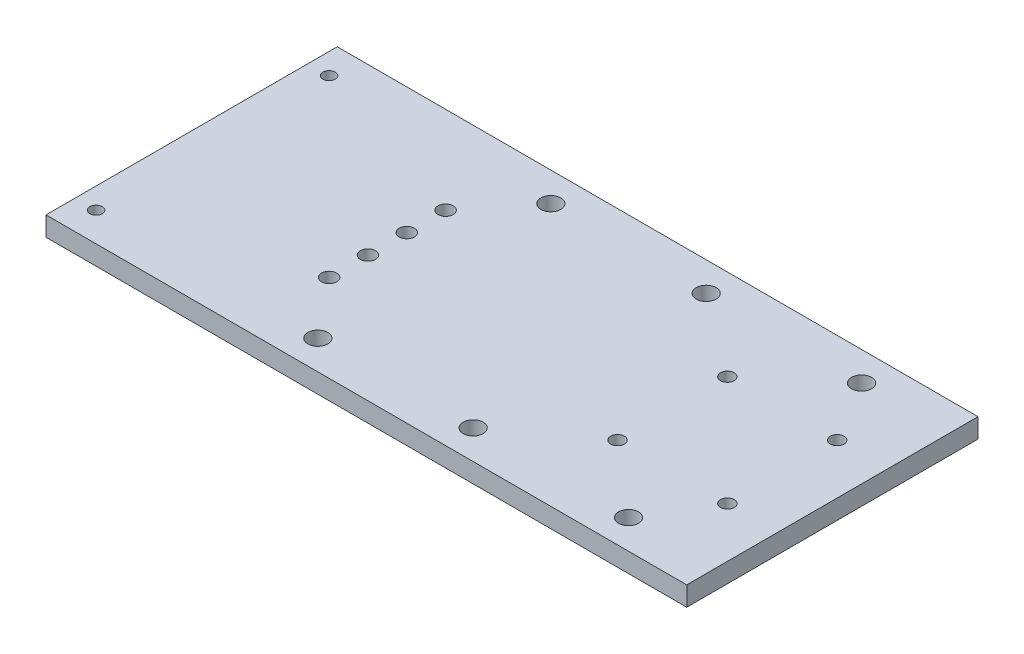
ISO-10303-21;
HEADER;
FILE_DESCRIPTION(('STEP AP214'),'2;1');
FILE_NAME('part.step','',(''),(''),'','','');
FILE_SCHEMA(('AUTOMOTIVE_DESIGN { 1 0 10303 214 1 1 1 1 }'));
ENDSEC;
DATA;
#1=APPLICATION_CONTEXT('core data for automotive mechanical design processes');
#2=APPLICATION_PROTOCOL_DEFINITION('international standard','automotive_design',2000,#1);
#3=PRODUCT_CONTEXT('',#1,'mechanical');
#4=PRODUCT('Part','Part','',(#3));
#5=PRODUCT_RELATED_PRODUCT_CATEGORY('part','',(#4));
#6=PRODUCT_DEFINITION_FORMATION('','',#4);
#7=PRODUCT_DEFINITION_CONTEXT('part definition',#1,'design');
#8=PRODUCT_DEFINITION('design','',#6,#7);
#9=PRODUCT_DEFINITION_SHAPE('','',#8);
#10=(LENGTH_UNIT() NAMED_UNIT(*) SI_UNIT(.MILLI.,.METRE.));
#11=(NAMED_UNIT(*) PLANE_ANGLE_UNIT() SI_UNIT($,.RADIAN.));
#12=(NAMED_UNIT(*) SI_UNIT($,.STERADIAN.) SOLID_ANGLE_UNIT());
#13=UNCERTAINTY_MEASURE_WITH_UNIT(LENGTH_MEASURE(1.E-05),#10,'distance_accuracy_value','');
#14=(GEOMETRIC_REPRESENTATION_CONTEXT(3) GLOBAL_UNCERTAINTY_ASSIGNED_CONTEXT((#13)) GLOBAL_UNIT_ASSIGNED_CONTEXT((#10,
#11,#12)) REPRESENTATION_CONTEXT('',''));
#15=CARTESIAN_POINT('',(0.,0.,0.));
#16=DIRECTION('',(0.,0.,1.));
#17=DIRECTION('',(1.,0.,0.));
#18=AXIS2_PLACEMENT_3D('',#15,#16,#17);
#19=CARTESIAN_POINT('',(104.775,6.35,47.625));
#20=DIRECTION('',(-1.,0.,0.));
#21=DIRECTION('',(0.,0.,1.));
#22=AXIS2_PLACEMENT_3D('',#19,#20,#21);
#23=PLANE('',#22);
#24=DIRECTION('',(0.,0.,-1.));
#25=VECTOR('',#24,1.);
#26=CARTESIAN_POINT('',(104.775,0.,47.625));
#27=LINE('',#26,#25);
#28=CARTESIAN_POINT('',(104.775,0.,47.625));
#29=VERTEX_POINT('',#28);
#30=CARTESIAN_POINT('',(104.775,0.,-47.625));
#31=VERTEX_POINT('',#30);
#32=EDGE_CURVE('E118',#29,#31,#27,.T.);
#33=ORIENTED_EDGE('',*,*,#32,.T.);
#34=DIRECTION('',(0.,-1.,0.));
#35=VECTOR('',#34,1.);
#36=CARTESIAN_POINT('',(104.775,6.35,-47.625));
#37=LINE('',#36,#35);
#38=CARTESIAN_POINT('',(104.775,6.35,-47.625));
#39=VERTEX_POINT('',#38);
#40=EDGE_CURVE('E13',#39,#31,#37,.T.);
#41=ORIENTED_EDGE('',*,*,#40,.F.);
#42=DIRECTION('',(0.,0.,-1.));
#43=VECTOR('',#42,1.);
#44=CARTESIAN_POINT('',(104.775,6.35,47.625));
#45=LINE('',#44,#43);
#46=CARTESIAN_POINT('',(104.775,6.35,47.625));
#47=VERTEX_POINT('',#46);
#48=EDGE_CURVE('E102',#47,#39,#45,.T.);
#49=ORIENTED_EDGE('',*,*,#48,.F.);
#50=DIRECTION('',(0.,-1.,0.));
#51=VECTOR('',#50,1.);
#52=CARTESIAN_POINT('',(104.775,6.35,47.625));
#53=LINE('',#52,#51);
#54=EDGE_CURVE('E114',#47,#29,#53,.T.);
#55=ORIENTED_EDGE('',*,*,#54,.T.);
#56=EDGE_LOOP('',(#33,#41,#49,#55));
#57=FACE_BOUND('',#56,.T.);
#58=ADVANCED_FACE('F50',(#57),#23,.F.);
#59=CARTESIAN_POINT('',(-104.775,6.35,-47.625));
#60=DIRECTION('',(0.,0.,1.));
#61=DIRECTION('',(1.,0.,0.));
#62=AXIS2_PLACEMENT_3D('',#59,#60,#61);
#63=PLANE('',#62);
#64=DIRECTION('',(-1.,0.,0.));
#65=VECTOR('',#64,1.);
#66=CARTESIAN_POINT('',(-104.775,0.,-47.625));
#67=LINE('',#66,#65);
#68=CARTESIAN_POINT('',(-104.775,0.,-47.625));
#69=VERTEX_POINT('',#68);
#70=EDGE_CURVE('E107',#31,#69,#67,.T.);
#71=ORIENTED_EDGE('',*,*,#70,.T.);
#72=DIRECTION('',(0.,-1.,0.));
#73=VECTOR('',#72,1.);
#74=CARTESIAN_POINT('',(-104.775,6.35,-47.625));
#75=LINE('',#74,#73);
#76=CARTESIAN_POINT('',(-104.775,6.35,-47.625));
#77=VERTEX_POINT('',#76);
#78=EDGE_CURVE('E59',#77,#69,#75,.T.);
#79=ORIENTED_EDGE('',*,*,#78,.F.);
#80=DIRECTION('',(-1.,0.,0.));
#81=VECTOR('',#80,1.);
#82=CARTESIAN_POINT('',(-104.775,6.35,-47.625));
#83=LINE('',#82,#81);
#84=EDGE_CURVE('E97',#39,#77,#83,.T.);
#85=ORIENTED_EDGE('',*,*,#84,.F.);
#86=ORIENTED_EDGE('',*,*,#40,.T.);
#87=EDGE_LOOP('',(#71,#79,#85,#86));
#88=FACE_BOUND('',#87,.T.);
#89=ADVANCED_FACE('F106',(#88),#63,.F.);
#90=CARTESIAN_POINT('',(-104.775,6.35,47.625));
#91=DIRECTION('',(1.,0.,0.));
#92=DIRECTION('',(0.,0.,-1.));
#93=AXIS2_PLACEMENT_3D('',#90,#91,#92);
#94=PLANE('',#93);
#95=DIRECTION('',(0.,0.,1.));
#96=VECTOR('',#95,1.);
#97=CARTESIAN_POINT('',(-104.775,0.,47.625));
#98=LINE('',#97,#96);
#99=CARTESIAN_POINT('',(-104.775,0.,47.625));
#100=VERTEX_POINT('',#99);
#101=EDGE_CURVE('E84',#69,#100,#98,.T.);
#102=ORIENTED_EDGE('',*,*,#101,.T.);
#103=DIRECTION('',(0.,-1.,0.));
#104=VECTOR('',#103,1.);
#105=CARTESIAN_POINT('',(-104.775,6.35,47.625));
#106=LINE('',#105,#104);
#107=CARTESIAN_POINT('',(-104.775,6.35,47.625));
#108=VERTEX_POINT('',#107);
#109=EDGE_CURVE('E109',#108,#100,#106,.T.);
#110=ORIENTED_EDGE('',*,*,#109,.F.);
#111=DIRECTION('',(0.,0.,1.));
#112=VECTOR('',#111,1.);
#113=CARTESIAN_POINT('',(-104.775,6.35,47.625));
#114=LINE('',#113,#112);
#115=EDGE_CURVE('E100',#77,#108,#114,.T.);
#116=ORIENTED_EDGE('',*,*,#115,.F.);
#117=ORIENTED_EDGE('',*,*,#78,.T.);
#118=EDGE_LOOP('',(#102,#110,#116,#117));
#119=FACE_BOUND('',#118,.T.);
#120=ADVANCED_FACE('F110',(#119),#94,.F.);
#121=CARTESIAN_POINT('',(-104.775,6.35,47.625));
#122=DIRECTION('',(0.,0.,-1.));
#123=DIRECTION('',(-1.,0.,0.));
#124=AXIS2_PLACEMENT_3D('',#121,#122,#123);
#125=PLANE('',#124);
#126=DIRECTION('',(1.,0.,0.));
#127=VECTOR('',#126,1.);
#128=CARTESIAN_POINT('',(-104.775,0.,47.625));
#129=LINE('',#128,#127);
#130=EDGE_CURVE('E90',#100,#29,#129,.T.);
#131=ORIENTED_EDGE('',*,*,#130,.T.);
#132=ORIENTED_EDGE('',*,*,#54,.F.);
#133=DIRECTION('',(1.,0.,0.));
#134=VECTOR('',#133,1.);
#135=CARTESIAN_POINT('',(-104.775,6.35,47.625));
#136=LINE('',#135,#134);
#137=EDGE_CURVE('E67',#108,#47,#136,.T.);
#138=ORIENTED_EDGE('',*,*,#137,.F.);
#139=ORIENTED_EDGE('',*,*,#109,.T.);
#140=EDGE_LOOP('',(#131,#132,#138,#139));
#141=FACE_BOUND('',#140,.T.);
#142=ADVANCED_FACE('F132',(#141),#125,.F.);
#143=CARTESIAN_POINT('',(0.,6.35,0.));
#144=DIRECTION('',(0.,-1.,0.));
#145=DIRECTION('',(0.,0.,-1.));
#146=AXIS2_PLACEMENT_3D('',#143,#144,#145);
#147=PLANE('',#146);
#148=CARTESIAN_POINT('',(-25.4,6.35,38.1));
#149=DIRECTION('',(0.,-1.,0.));
#150=DIRECTION('',(0.,0.,-1.));
#151=AXIS2_PLACEMENT_3D('',#148,#149,#150);
#152=CIRCLE('',#151,3.2639);
#153=CARTESIAN_POINT('',(-25.4,6.35,34.8361));
#154=VERTEX_POINT('',#153);
#155=EDGE_CURVE('E259',#154,#154,#152,.T.);
#156=ORIENTED_EDGE('',*,*,#155,.T.);
#157=EDGE_LOOP('',(#156));
#158=FACE_BOUND('',#157,.T.);
#159=CARTESIAN_POINT('',(25.4,6.35,38.1));
#160=DIRECTION('',(0.,-1.,0.));
#161=DIRECTION('',(0.,0.,-1.));
#162=AXIS2_PLACEMENT_3D('',#159,#160,#161);
#163=CIRCLE('',#162,3.2639);
#164=CARTESIAN_POINT('',(25.4,6.35,34.8361));
#165=VERTEX_POINT('',#164);
#166=EDGE_CURVE('E251',#165,#165,#163,.T.);
#167=ORIENTED_EDGE('',*,*,#166,.T.);
#168=EDGE_LOOP('',(#167));
#169=FACE_BOUND('',#168,.T.);
#170=CARTESIAN_POINT('',(76.2,6.35,38.1));
#171=DIRECTION('',(0.,-1.,0.));
#172=DIRECTION('',(0.,0.,-1.));
#173=AXIS2_PLACEMENT_3D('',#170,#171,#172);
#174=CIRCLE('',#173,3.2639);
#175=CARTESIAN_POINT('',(76.2,6.35,34.8361));
#176=VERTEX_POINT('',#175);
#177=EDGE_CURVE('E243',#176,#176,#174,.T.);
#178=ORIENTED_EDGE('',*,*,#177,.T.);
#179=EDGE_LOOP('',(#178));
#180=FACE_BOUND('',#179,.T.);
#181=CARTESIAN_POINT('',(-25.4,6.35,-38.1));
#182=DIRECTION('',(0.,1.,0.));
#183=DIRECTION('',(0.,0.,1.));
#184=AXIS2_PLACEMENT_3D('',#181,#182,#183);
#185=CIRCLE('',#184,3.2639);
#186=CARTESIAN_POINT('',(-25.4,6.35,-34.8361));
#187=VERTEX_POINT('',#186);
#188=EDGE_CURVE('E236',#187,#187,#185,.T.);
#189=ORIENTED_EDGE('',*,*,#188,.F.);
#190=EDGE_LOOP('',(#189));
#191=FACE_BOUND('',#190,.T.);
#192=CARTESIAN_POINT('',(25.4,6.35,-38.1));
#193=DIRECTION('',(0.,1.,0.));
#194=DIRECTION('',(0.,0.,1.));
#195=AXIS2_PLACEMENT_3D('',#192,#193,#194);
#196=CIRCLE('',#195,3.2639);
#197=CARTESIAN_POINT('',(25.4,6.35,-34.8361));
#198=VERTEX_POINT('',#197);
#199=EDGE_CURVE('E228',#198,#198,#196,.T.);
#200=ORIENTED_EDGE('',*,*,#199,.F.);
#201=EDGE_LOOP('',(#200));
#202=FACE_BOUND('',#201,.T.);
#203=CARTESIAN_POINT('',(76.2,6.35,-38.1));
#204=DIRECTION('',(0.,1.,0.));
#205=DIRECTION('',(0.,0.,1.));
#206=AXIS2_PLACEMENT_3D('',#203,#204,#205);
#207=CIRCLE('',#206,3.2639);
#208=CARTESIAN_POINT('',(76.2,6.35,-34.8361));
#209=VERTEX_POINT('',#208);
#210=EDGE_CURVE('E219',#209,#209,#207,.T.);
#211=ORIENTED_EDGE('',*,*,#210,.F.);
#212=EDGE_LOOP('',(#211));
#213=FACE_BOUND('',#212,.T.);
#214=CARTESIAN_POINT('',(52.47132,6.35,17.96034));
#215=DIRECTION('',(0.,1.,0.));
#216=DIRECTION('',(0.,0.,1.));
#217=AXIS2_PLACEMENT_3D('',#214,#215,#216);
#218=CIRCLE('',#217,2.2479);
#219=CARTESIAN_POINT('',(52.47132,6.35,20.20824));
#220=VERTEX_POINT('',#219);
#221=EDGE_CURVE('E195',#220,#220,#218,.T.);
#222=ORIENTED_EDGE('',*,*,#221,.F.);
#223=EDGE_LOOP('',(#222));
#224=FACE_BOUND('',#223,.T.);
#225=CARTESIAN_POINT('',(88.392,6.35,17.96034));
#226=DIRECTION('',(0.,1.,0.));
#227=DIRECTION('',(0.,0.,1.));
#228=AXIS2_PLACEMENT_3D('',#225,#226,#227);
#229=CIRCLE('',#228,2.2479);
#230=CARTESIAN_POINT('',(88.392,6.35,20.20824));
#231=VERTEX_POINT('',#230);
#232=EDGE_CURVE('E204',#231,#231,#229,.T.);
#233=ORIENTED_EDGE('',*,*,#232,.F.);
#234=EDGE_LOOP('',(#233));
#235=FACE_BOUND('',#234,.T.);
#236=CARTESIAN_POINT('',(88.392,6.35,-17.96034));
#237=DIRECTION('',(0.,1.,0.));
#238=DIRECTION('',(0.,0.,1.));
#239=AXIS2_PLACEMENT_3D('',#236,#237,#238);
#240=CIRCLE('',#239,2.2479);
#241=CARTESIAN_POINT('',(88.392,6.35,-15.71244));
#242=VERTEX_POINT('',#241);
#243=EDGE_CURVE('E212',#242,#242,#240,.T.);
#244=ORIENTED_EDGE('',*,*,#243,.F.);
#245=EDGE_LOOP('',(#244));
#246=FACE_BOUND('',#245,.T.);
#247=CARTESIAN_POINT('',(52.47132,6.35,-17.96034));
#248=DIRECTION('',(0.,1.,0.));
#249=DIRECTION('',(0.,0.,1.));
#250=AXIS2_PLACEMENT_3D('',#247,#248,#249);
#251=CIRCLE('',#250,2.2479);
#252=CARTESIAN_POINT('',(52.47132,6.35,-15.71244));
#253=VERTEX_POINT('',#252);
#254=EDGE_CURVE('E187',#253,#253,#251,.T.);
#255=ORIENTED_EDGE('',*,*,#254,.F.);
#256=EDGE_LOOP('',(#255));
#257=FACE_BOUND('',#256,.T.);
#258=CARTESIAN_POINT('',(-40.767,6.35,-6.35));
#259=DIRECTION('',(0.,-1.,0.));
#260=DIRECTION('',(0.,0.,-1.));
#261=AXIS2_PLACEMENT_3D('',#258,#259,#260);
#262=CIRCLE('',#261,2.4892);
#263=CARTESIAN_POINT('',(-40.767,6.35,-8.83920000000001));
#264=VERTEX_POINT('',#263);
#265=EDGE_CURVE('E180',#264,#264,#262,.T.);
#266=ORIENTED_EDGE('',*,*,#265,.T.);
#267=EDGE_LOOP('',(#266));
#268=FACE_BOUND('',#267,.T.);
#269=CARTESIAN_POINT('',(-40.767,6.35,-19.05));
#270=DIRECTION('',(0.,-1.,0.));
#271=DIRECTION('',(0.,0.,-1.));
#272=AXIS2_PLACEMENT_3D('',#269,#270,#271);
#273=CIRCLE('',#272,2.4892);
#274=CARTESIAN_POINT('',(-40.767,6.35,-21.5392));
#275=VERTEX_POINT('',#274);
#276=EDGE_CURVE('E171',#275,#275,#273,.T.);
#277=ORIENTED_EDGE('',*,*,#276,.T.);
#278=EDGE_LOOP('',(#277));
#279=FACE_BOUND('',#278,.T.);
#280=CARTESIAN_POINT('',(-40.767,6.35,6.35));
#281=DIRECTION('',(0.,1.,0.));
#282=DIRECTION('',(0.,0.,1.));
#283=AXIS2_PLACEMENT_3D('',#280,#281,#282);
#284=CIRCLE('',#283,2.4892);
#285=CARTESIAN_POINT('',(-40.767,6.35,8.83920000000001));
#286=VERTEX_POINT('',#285);
#287=EDGE_CURVE('E164',#286,#286,#284,.T.);
#288=ORIENTED_EDGE('',*,*,#287,.F.);
#289=EDGE_LOOP('',(#288));
#290=FACE_BOUND('',#289,.T.);
#291=CARTESIAN_POINT('',(-40.767,6.35,19.05));
#292=DIRECTION('',(0.,1.,0.));
#293=DIRECTION('',(0.,0.,1.));
#294=AXIS2_PLACEMENT_3D('',#291,#292,#293);
#295=CIRCLE('',#294,2.4892);
#296=CARTESIAN_POINT('',(-40.767,6.35,21.5392));
#297=VERTEX_POINT('',#296);
#298=EDGE_CURVE('E155',#297,#297,#295,.T.);
#299=ORIENTED_EDGE('',*,*,#298,.F.);
#300=EDGE_LOOP('',(#299));
#301=FACE_BOUND('',#300,.T.);
#302=CARTESIAN_POINT('',(-97.917,6.35,-38.1));
#303=DIRECTION('',(0.,-1.,0.));
#304=DIRECTION('',(0.,0.,-1.));
#305=AXIS2_PLACEMENT_3D('',#302,#303,#304);
#306=CIRCLE('',#305,2.01930000000001);
#307=CARTESIAN_POINT('',(-97.917,6.35,-40.1193));
#308=VERTEX_POINT('',#307);
#309=EDGE_CURVE('E147',#308,#308,#306,.T.);
#310=ORIENTED_EDGE('',*,*,#309,.T.);
#311=EDGE_LOOP('',(#310));
#312=FACE_BOUND('',#311,.T.);
#313=CARTESIAN_POINT('',(-97.917,6.35,38.1));
#314=DIRECTION('',(0.,1.,0.));
#315=DIRECTION('',(0.,0.,1.));
#316=AXIS2_PLACEMENT_3D('',#313,#314,#315);
#317=CIRCLE('',#316,2.01930000000001);
#318=CARTESIAN_POINT('',(-97.917,6.35,40.1193));
#319=VERTEX_POINT('',#318);
#320=EDGE_CURVE('E139',#319,#319,#317,.T.);
#321=ORIENTED_EDGE('',*,*,#320,.F.);
#322=EDGE_LOOP('',(#321));
#323=FACE_BOUND('',#322,.T.);
#324=ORIENTED_EDGE('',*,*,#48,.T.);
#325=ORIENTED_EDGE('',*,*,#84,.T.);
#326=ORIENTED_EDGE('',*,*,#115,.T.);
#327=ORIENTED_EDGE('',*,*,#137,.T.);
#328=EDGE_LOOP('',(#324,#325,#326,#327));
#329=FACE_BOUND('',#328,.T.);
#330=ADVANCED_FACE('F98',(#158,#169,#180,#191,#202,#213,#224,#235,#246,#257,#268,#279,#290,#301,
#312,#323,#329),#147,.F.);
#331=CARTESIAN_POINT('',(0.,0.,0.));
#332=DIRECTION('',(0.,-1.,0.));
#333=DIRECTION('',(0.,0.,-1.));
#334=AXIS2_PLACEMENT_3D('',#331,#332,#333);
#335=PLANE('',#334);
#336=CARTESIAN_POINT('',(-25.4,0.,38.1));
#337=DIRECTION('',(0.,-1.,0.));
#338=DIRECTION('',(0.,0.,-1.));
#339=AXIS2_PLACEMENT_3D('',#336,#337,#338);
#340=CIRCLE('',#339,3.2639);
#341=CARTESIAN_POINT('',(-25.4,0.,34.8361));
#342=VERTEX_POINT('',#341);
#343=EDGE_CURVE('E224',#342,#342,#340,.T.);
#344=ORIENTED_EDGE('',*,*,#343,.F.);
#345=EDGE_LOOP('',(#344));
#346=FACE_BOUND('',#345,.T.);
#347=CARTESIAN_POINT('',(25.4,0.,38.1));
#348=DIRECTION('',(0.,-1.,0.));
#349=DIRECTION('',(0.,0.,-1.));
#350=AXIS2_PLACEMENT_3D('',#347,#348,#349);
#351=CIRCLE('',#350,3.2639);
#352=CARTESIAN_POINT('',(25.4,0.,34.8361));
#353=VERTEX_POINT('',#352);
#354=EDGE_CURVE('E255',#353,#353,#351,.T.);
#355=ORIENTED_EDGE('',*,*,#354,.F.);
#356=EDGE_LOOP('',(#355));
#357=FACE_BOUND('',#356,.T.);
#358=CARTESIAN_POINT('',(76.2,0.,38.1));
#359=DIRECTION('',(0.,-1.,0.));
#360=DIRECTION('',(0.,0.,-1.));
#361=AXIS2_PLACEMENT_3D('',#358,#359,#360);
#362=CIRCLE('',#361,3.2639);
#363=CARTESIAN_POINT('',(76.2,0.,34.8361));
#364=VERTEX_POINT('',#363);
#365=EDGE_CURVE('E247',#364,#364,#362,.T.);
#366=ORIENTED_EDGE('',*,*,#365,.F.);
#367=EDGE_LOOP('',(#366));
#368=FACE_BOUND('',#367,.T.);
#369=CARTESIAN_POINT('',(-25.4,0.,-38.1));
#370=DIRECTION('',(0.,1.,0.));
#371=DIRECTION('',(0.,0.,1.));
#372=AXIS2_PLACEMENT_3D('',#369,#370,#371);
#373=CIRCLE('',#372,3.2639);
#374=CARTESIAN_POINT('',(-25.4,0.,-34.8361));
#375=VERTEX_POINT('',#374);
#376=EDGE_CURVE('E200',#375,#375,#373,.T.);
#377=ORIENTED_EDGE('',*,*,#376,.T.);
#378=EDGE_LOOP('',(#377));
#379=FACE_BOUND('',#378,.T.);
#380=CARTESIAN_POINT('',(25.4,0.,-38.1));
#381=DIRECTION('',(0.,1.,0.));
#382=DIRECTION('',(0.,0.,1.));
#383=AXIS2_PLACEMENT_3D('',#380,#381,#382);
#384=CIRCLE('',#383,3.2639);
#385=CARTESIAN_POINT('',(25.4,0.,-34.8361));
#386=VERTEX_POINT('',#385);
#387=EDGE_CURVE('E232',#386,#386,#384,.T.);
#388=ORIENTED_EDGE('',*,*,#387,.T.);
#389=EDGE_LOOP('',(#388));
#390=FACE_BOUND('',#389,.T.);
#391=CARTESIAN_POINT('',(76.2,0.,-38.1));
#392=DIRECTION('',(0.,1.,0.));
#393=DIRECTION('',(0.,0.,1.));
#394=AXIS2_PLACEMENT_3D('',#391,#392,#393);
#395=CIRCLE('',#394,3.2639);
#396=CARTESIAN_POINT('',(76.2,0.,-34.8361));
#397=VERTEX_POINT('',#396);
#398=EDGE_CURVE('E223',#397,#397,#395,.T.);
#399=ORIENTED_EDGE('',*,*,#398,.T.);
#400=EDGE_LOOP('',(#399));
#401=FACE_BOUND('',#400,.T.);
#402=CARTESIAN_POINT('',(52.47132,0.,17.96034));
#403=DIRECTION('',(0.,1.,0.));
#404=DIRECTION('',(0.,0.,1.));
#405=AXIS2_PLACEMENT_3D('',#402,#403,#404);
#406=CIRCLE('',#405,2.2479);
#407=CARTESIAN_POINT('',(52.47132,0.,20.20824));
#408=VERTEX_POINT('',#407);
#409=EDGE_CURVE('E199',#408,#408,#406,.T.);
#410=ORIENTED_EDGE('',*,*,#409,.T.);
#411=EDGE_LOOP('',(#410));
#412=FACE_BOUND('',#411,.T.);
#413=CARTESIAN_POINT('',(88.392,0.,17.96034));
#414=DIRECTION('',(0.,1.,0.));
#415=DIRECTION('',(0.,0.,1.));
#416=AXIS2_PLACEMENT_3D('',#413,#414,#415);
#417=CIRCLE('',#416,2.2479);
#418=CARTESIAN_POINT('',(88.392,0.,20.20824));
#419=VERTEX_POINT('',#418);
#420=EDGE_CURVE('E208',#419,#419,#417,.T.);
#421=ORIENTED_EDGE('',*,*,#420,.T.);
#422=EDGE_LOOP('',(#421));
#423=FACE_BOUND('',#422,.T.);
#424=CARTESIAN_POINT('',(88.392,0.,-17.96034));
#425=DIRECTION('',(0.,1.,0.));
#426=DIRECTION('',(0.,0.,1.));
#427=AXIS2_PLACEMENT_3D('',#424,#425,#426);
#428=CIRCLE('',#427,2.2479);
#429=CARTESIAN_POINT('',(88.392,0.,-15.71244));
#430=VERTEX_POINT('',#429);
#431=EDGE_CURVE('E191',#430,#430,#428,.T.);
#432=ORIENTED_EDGE('',*,*,#431,.T.);
#433=EDGE_LOOP('',(#432));
#434=FACE_BOUND('',#433,.T.);
#435=CARTESIAN_POINT('',(52.47132,0.,-17.96034));
#436=DIRECTION('',(0.,1.,0.));
#437=DIRECTION('',(0.,0.,1.));
#438=AXIS2_PLACEMENT_3D('',#435,#436,#437);
#439=CIRCLE('',#438,2.2479);
#440=CARTESIAN_POINT('',(52.47132,0.,-15.71244));
#441=VERTEX_POINT('',#440);
#442=EDGE_CURVE('E176',#441,#441,#439,.T.);
#443=ORIENTED_EDGE('',*,*,#442,.T.);
#444=EDGE_LOOP('',(#443));
#445=FACE_BOUND('',#444,.T.);
#446=CARTESIAN_POINT('',(-40.767,0.,-6.35));
#447=DIRECTION('',(0.,-1.,0.));
#448=DIRECTION('',(0.,0.,-1.));
#449=AXIS2_PLACEMENT_3D('',#446,#447,#448);
#450=CIRCLE('',#449,2.4892);
#451=CARTESIAN_POINT('',(-40.767,0.,-8.83920000000001));
#452=VERTEX_POINT('',#451);
#453=EDGE_CURVE('E160',#452,#452,#450,.T.);
#454=ORIENTED_EDGE('',*,*,#453,.F.);
#455=EDGE_LOOP('',(#454));
#456=FACE_BOUND('',#455,.T.);
#457=CARTESIAN_POINT('',(-40.767,0.,-19.05));
#458=DIRECTION('',(0.,-1.,0.));
#459=DIRECTION('',(0.,0.,-1.));
#460=AXIS2_PLACEMENT_3D('',#457,#458,#459);
#461=CIRCLE('',#460,2.4892);
#462=CARTESIAN_POINT('',(-40.767,0.,-21.5392));
#463=VERTEX_POINT('',#462);
#464=EDGE_CURVE('E175',#463,#463,#461,.T.);
#465=ORIENTED_EDGE('',*,*,#464,.F.);
#466=EDGE_LOOP('',(#465));
#467=FACE_BOUND('',#466,.T.);
#468=CARTESIAN_POINT('',(-40.767,0.,6.35));
#469=DIRECTION('',(0.,1.,0.));
#470=DIRECTION('',(0.,0.,1.));
#471=AXIS2_PLACEMENT_3D('',#468,#469,#470);
#472=CIRCLE('',#471,2.4892);
#473=CARTESIAN_POINT('',(-40.767,0.,8.83920000000001));
#474=VERTEX_POINT('',#473);
#475=EDGE_CURVE('E151',#474,#474,#472,.T.);
#476=ORIENTED_EDGE('',*,*,#475,.T.);
#477=EDGE_LOOP('',(#476));
#478=FACE_BOUND('',#477,.T.);
#479=CARTESIAN_POINT('',(-40.767,0.,19.05));
#480=DIRECTION('',(0.,1.,0.));
#481=DIRECTION('',(0.,0.,1.));
#482=AXIS2_PLACEMENT_3D('',#479,#480,#481);
#483=CIRCLE('',#482,2.4892);
#484=CARTESIAN_POINT('',(-40.767,0.,21.5392));
#485=VERTEX_POINT('',#484);
#486=EDGE_CURVE('E159',#485,#485,#483,.T.);
#487=ORIENTED_EDGE('',*,*,#486,.T.);
#488=EDGE_LOOP('',(#487));
#489=FACE_BOUND('',#488,.T.);
#490=CARTESIAN_POINT('',(-97.917,0.,-38.1));
#491=DIRECTION('',(0.,-1.,0.));
#492=DIRECTION('',(0.,0.,-1.));
#493=AXIS2_PLACEMENT_3D('',#490,#491,#492);
#494=CIRCLE('',#493,2.01930000000001);
#495=CARTESIAN_POINT('',(-97.917,0.,-40.1193));
#496=VERTEX_POINT('',#495);
#497=EDGE_CURVE('E143',#496,#496,#494,.T.);
#498=ORIENTED_EDGE('',*,*,#497,.F.);
#499=EDGE_LOOP('',(#498));
#500=FACE_BOUND('',#499,.T.);
#501=CARTESIAN_POINT('',(-97.917,0.,38.1));
#502=DIRECTION('',(0.,1.,0.));
#503=DIRECTION('',(0.,0.,1.));
#504=AXIS2_PLACEMENT_3D('',#501,#502,#503);
#505=CIRCLE('',#504,2.01930000000001);
#506=CARTESIAN_POINT('',(-97.917,0.,40.1193));
#507=VERTEX_POINT('',#506);
#508=EDGE_CURVE('E122',#507,#507,#505,.T.);
#509=ORIENTED_EDGE('',*,*,#508,.T.);
#510=EDGE_LOOP('',(#509));
#511=FACE_BOUND('',#510,.T.);
#512=ORIENTED_EDGE('',*,*,#32,.F.);
#513=ORIENTED_EDGE('',*,*,#130,.F.);
#514=ORIENTED_EDGE('',*,*,#101,.F.);
#515=ORIENTED_EDGE('',*,*,#70,.F.);
#516=EDGE_LOOP('',(#512,#513,#514,#515));
#517=FACE_BOUND('',#516,.T.);
#518=ADVANCED_FACE('F135',(#346,#357,#368,#379,#390,#401,#412,#423,#434,#445,#456,#467,#478,
#489,#500,#511,#517),#335,.T.);
#519=CARTESIAN_POINT('',(-97.917,0.,38.1));
#520=DIRECTION('',(0.,1.,0.));
#521=DIRECTION('',(0.,0.,1.));
#522=AXIS2_PLACEMENT_3D('',#519,#520,#521);
#523=CYLINDRICAL_SURFACE('',#522,2.01930000000001);
#524=ORIENTED_EDGE('',*,*,#508,.F.);
#525=EDGE_LOOP('',(#524));
#526=FACE_BOUND('',#525,.T.);
#527=ORIENTED_EDGE('',*,*,#320,.T.);
#528=EDGE_LOOP('',(#527));
#529=FACE_BOUND('',#528,.T.);
#530=ADVANCED_FACE('F272',(#526,#529),#523,.F.);
#531=CARTESIAN_POINT('',(-97.917,0.,-38.1));
#532=DIRECTION('',(0.,1.,0.));
#533=DIRECTION('',(0.,0.,1.));
#534=AXIS2_PLACEMENT_3D('',#531,#532,#533);
#535=CYLINDRICAL_SURFACE('',#534,2.01930000000001);
#536=ORIENTED_EDGE('',*,*,#497,.T.);
#537=EDGE_LOOP('',(#536));
#538=FACE_BOUND('',#537,.T.);
#539=ORIENTED_EDGE('',*,*,#309,.F.);
#540=EDGE_LOOP('',(#539));
#541=FACE_BOUND('',#540,.T.);
#542=ADVANCED_FACE('F306',(#538,#541),#535,.F.);
#543=CARTESIAN_POINT('',(-40.767,0.,19.05));
#544=DIRECTION('',(0.,1.,0.));
#545=DIRECTION('',(0.,0.,1.));
#546=AXIS2_PLACEMENT_3D('',#543,#544,#545);
#547=CYLINDRICAL_SURFACE('',#546,2.4892);
#548=ORIENTED_EDGE('',*,*,#486,.F.);
#549=EDGE_LOOP('',(#548));
#550=FACE_BOUND('',#549,.T.);
#551=ORIENTED_EDGE('',*,*,#298,.T.);
#552=EDGE_LOOP('',(#551));
#553=FACE_BOUND('',#552,.T.);
#554=ADVANCED_FACE('F354',(#550,#553),#547,.F.);
#555=CARTESIAN_POINT('',(-40.767,0.,6.35));
#556=DIRECTION('',(0.,1.,0.));
#557=DIRECTION('',(0.,0.,1.));
#558=AXIS2_PLACEMENT_3D('',#555,#556,#557);
#559=CYLINDRICAL_SURFACE('',#558,2.4892);
#560=ORIENTED_EDGE('',*,*,#475,.F.);
#561=EDGE_LOOP('',(#560));
#562=FACE_BOUND('',#561,.T.);
#563=ORIENTED_EDGE('',*,*,#287,.T.);
#564=EDGE_LOOP('',(#563));
#565=FACE_BOUND('',#564,.T.);
#566=ADVANCED_FACE('F362',(#562,#565),#559,.F.);
#567=CARTESIAN_POINT('',(-40.767,0.,-19.05));
#568=DIRECTION('',(0.,1.,0.));
#569=DIRECTION('',(0.,0.,1.));
#570=AXIS2_PLACEMENT_3D('',#567,#568,#569);
#571=CYLINDRICAL_SURFACE('',#570,2.4892);
#572=ORIENTED_EDGE('',*,*,#464,.T.);
#573=EDGE_LOOP('',(#572));
#574=FACE_BOUND('',#573,.T.);
#575=ORIENTED_EDGE('',*,*,#276,.F.);
#576=EDGE_LOOP('',(#575));
#577=FACE_BOUND('',#576,.T.);
#578=ADVANCED_FACE('F370',(#574,#577),#571,.F.);
#579=CARTESIAN_POINT('',(-40.767,0.,-6.35));
#580=DIRECTION('',(0.,1.,0.));
#581=DIRECTION('',(0.,0.,1.));
#582=AXIS2_PLACEMENT_3D('',#579,#580,#581);
#583=CYLINDRICAL_SURFACE('',#582,2.4892);
#584=ORIENTED_EDGE('',*,*,#453,.T.);
#585=EDGE_LOOP('',(#584));
#586=FACE_BOUND('',#585,.T.);
#587=ORIENTED_EDGE('',*,*,#265,.F.);
#588=EDGE_LOOP('',(#587));
#589=FACE_BOUND('',#588,.T.);
#590=ADVANCED_FACE('F378',(#586,#589),#583,.F.);
#591=CARTESIAN_POINT('',(52.47132,0.,-17.96034));
#592=DIRECTION('',(0.,1.,0.));
#593=DIRECTION('',(0.,0.,1.));
#594=AXIS2_PLACEMENT_3D('',#591,#592,#593);
#595=CYLINDRICAL_SURFACE('',#594,2.2479);
#596=ORIENTED_EDGE('',*,*,#442,.F.);
#597=EDGE_LOOP('',(#596));
#598=FACE_BOUND('',#597,.T.);
#599=ORIENTED_EDGE('',*,*,#254,.T.);
#600=EDGE_LOOP('',(#599));
#601=FACE_BOUND('',#600,.T.);
#602=ADVANCED_FACE('F386',(#598,#601),#595,.F.);
#603=CARTESIAN_POINT('',(88.392,0.,-17.96034));
#604=DIRECTION('',(0.,1.,0.));
#605=DIRECTION('',(0.,0.,1.));
#606=AXIS2_PLACEMENT_3D('',#603,#604,#605);
#607=CYLINDRICAL_SURFACE('',#606,2.2479);
#608=ORIENTED_EDGE('',*,*,#431,.F.);
#609=EDGE_LOOP('',(#608));
#610=FACE_BOUND('',#609,.T.);
#611=ORIENTED_EDGE('',*,*,#243,.T.);
#612=EDGE_LOOP('',(#611));
#613=FACE_BOUND('',#612,.T.);
#614=ADVANCED_FACE('F394',(#610,#613),#607,.F.);
#615=CARTESIAN_POINT('',(88.392,0.,17.96034));
#616=DIRECTION('',(0.,1.,0.));
#617=DIRECTION('',(0.,0.,1.));
#618=AXIS2_PLACEMENT_3D('',#615,#616,#617);
#619=CYLINDRICAL_SURFACE('',#618,2.2479);
#620=ORIENTED_EDGE('',*,*,#420,.F.);
#621=EDGE_LOOP('',(#620));
#622=FACE_BOUND('',#621,.T.);
#623=ORIENTED_EDGE('',*,*,#232,.T.);
#624=EDGE_LOOP('',(#623));
#625=FACE_BOUND('',#624,.T.);
#626=ADVANCED_FACE('F402',(#622,#625),#619,.F.);
#627=CARTESIAN_POINT('',(52.47132,0.,17.96034));
#628=DIRECTION('',(0.,1.,0.));
#629=DIRECTION('',(0.,0.,1.));
#630=AXIS2_PLACEMENT_3D('',#627,#628,#629);
#631=CYLINDRICAL_SURFACE('',#630,2.2479);
#632=ORIENTED_EDGE('',*,*,#409,.F.);
#633=EDGE_LOOP('',(#632));
#634=FACE_BOUND('',#633,.T.);
#635=ORIENTED_EDGE('',*,*,#221,.T.);
#636=EDGE_LOOP('',(#635));
#637=FACE_BOUND('',#636,.T.);
#638=ADVANCED_FACE('F410',(#634,#637),#631,.F.);
#639=CARTESIAN_POINT('',(76.2,0.,-38.1));
#640=DIRECTION('',(0.,1.,0.));
#641=DIRECTION('',(0.,0.,1.));
#642=AXIS2_PLACEMENT_3D('',#639,#640,#641);
#643=CYLINDRICAL_SURFACE('',#642,3.2639);
#644=ORIENTED_EDGE('',*,*,#398,.F.);
#645=EDGE_LOOP('',(#644));
#646=FACE_BOUND('',#645,.T.);
#647=ORIENTED_EDGE('',*,*,#210,.T.);
#648=EDGE_LOOP('',(#647));
#649=FACE_BOUND('',#648,.T.);
#650=ADVANCED_FACE('F418',(#646,#649),#643,.F.);
#651=CARTESIAN_POINT('',(25.4,0.,-38.1));
#652=DIRECTION('',(0.,1.,0.));
#653=DIRECTION('',(0.,0.,1.));
#654=AXIS2_PLACEMENT_3D('',#651,#652,#653);
#655=CYLINDRICAL_SURFACE('',#654,3.2639);
#656=ORIENTED_EDGE('',*,*,#387,.F.);
#657=EDGE_LOOP('',(#656));
#658=FACE_BOUND('',#657,.T.);
#659=ORIENTED_EDGE('',*,*,#199,.T.);
#660=EDGE_LOOP('',(#659));
#661=FACE_BOUND('',#660,.T.);
#662=ADVANCED_FACE('F426',(#658,#661),#655,.F.);
#663=CARTESIAN_POINT('',(-25.4,0.,-38.1));
#664=DIRECTION('',(0.,1.,0.));
#665=DIRECTION('',(0.,0.,1.));
#666=AXIS2_PLACEMENT_3D('',#663,#664,#665);
#667=CYLINDRICAL_SURFACE('',#666,3.2639);
#668=ORIENTED_EDGE('',*,*,#376,.F.);
#669=EDGE_LOOP('',(#668));
#670=FACE_BOUND('',#669,.T.);
#671=ORIENTED_EDGE('',*,*,#188,.T.);
#672=EDGE_LOOP('',(#671));
#673=FACE_BOUND('',#672,.T.);
#674=ADVANCED_FACE('F434',(#670,#673),#667,.F.);
#675=CARTESIAN_POINT('',(76.2,0.,38.1));
#676=DIRECTION('',(0.,1.,0.));
#677=DIRECTION('',(0.,0.,1.));
#678=AXIS2_PLACEMENT_3D('',#675,#676,#677);
#679=CYLINDRICAL_SURFACE('',#678,3.2639);
#680=ORIENTED_EDGE('',*,*,#365,.T.);
#681=EDGE_LOOP('',(#680));
#682=FACE_BOUND('',#681,.T.);
#683=ORIENTED_EDGE('',*,*,#177,.F.);
#684=EDGE_LOOP('',(#683));
#685=FACE_BOUND('',#684,.T.);
#686=ADVANCED_FACE('F441',(#682,#685),#679,.F.);
#687=CARTESIAN_POINT('',(25.4,0.,38.1));
#688=DIRECTION('',(0.,1.,0.));
#689=DIRECTION('',(0.,0.,1.));
#690=AXIS2_PLACEMENT_3D('',#687,#688,#689);
#691=CYLINDRICAL_SURFACE('',#690,3.2639);
#692=ORIENTED_EDGE('',*,*,#354,.T.);
#693=EDGE_LOOP('',(#692));
#694=FACE_BOUND('',#693,.T.);
#695=ORIENTED_EDGE('',*,*,#166,.F.);
#696=EDGE_LOOP('',(#695));
#697=FACE_BOUND('',#696,.T.);
#698=ADVANCED_FACE('F448',(#694,#697),#691,.F.);
#699=CARTESIAN_POINT('',(-25.4,0.,38.1));
#700=DIRECTION('',(0.,1.,0.));
#701=DIRECTION('',(0.,0.,1.));
#702=AXIS2_PLACEMENT_3D('',#699,#700,#701);
#703=CYLINDRICAL_SURFACE('',#702,3.2639);
#704=ORIENTED_EDGE('',*,*,#343,.T.);
#705=EDGE_LOOP('',(#704));
#706=FACE_BOUND('',#705,.T.);
#707=ORIENTED_EDGE('',*,*,#155,.F.);
#708=EDGE_LOOP('',(#707));
#709=FACE_BOUND('',#708,.T.);
#710=ADVANCED_FACE('F267',(#706,#709),#703,.F.);
#711=CLOSED_SHELL('',(#58,#89,#120,#142,#330,#518,#530,#542,#554,#566,#578,#590,#602,#614,#626,
#638,#650,#662,#674,#686,#698,#710));
#712=MANIFOLD_SOLID_BREP('B2',#711);
#713=ADVANCED_BREP_SHAPE_REPRESENTATION('',(#18,#712),#14);
#714=SHAPE_DEFINITION_REPRESENTATION(#9,#713);
ENDSEC;
END-ISO-10303-21;
